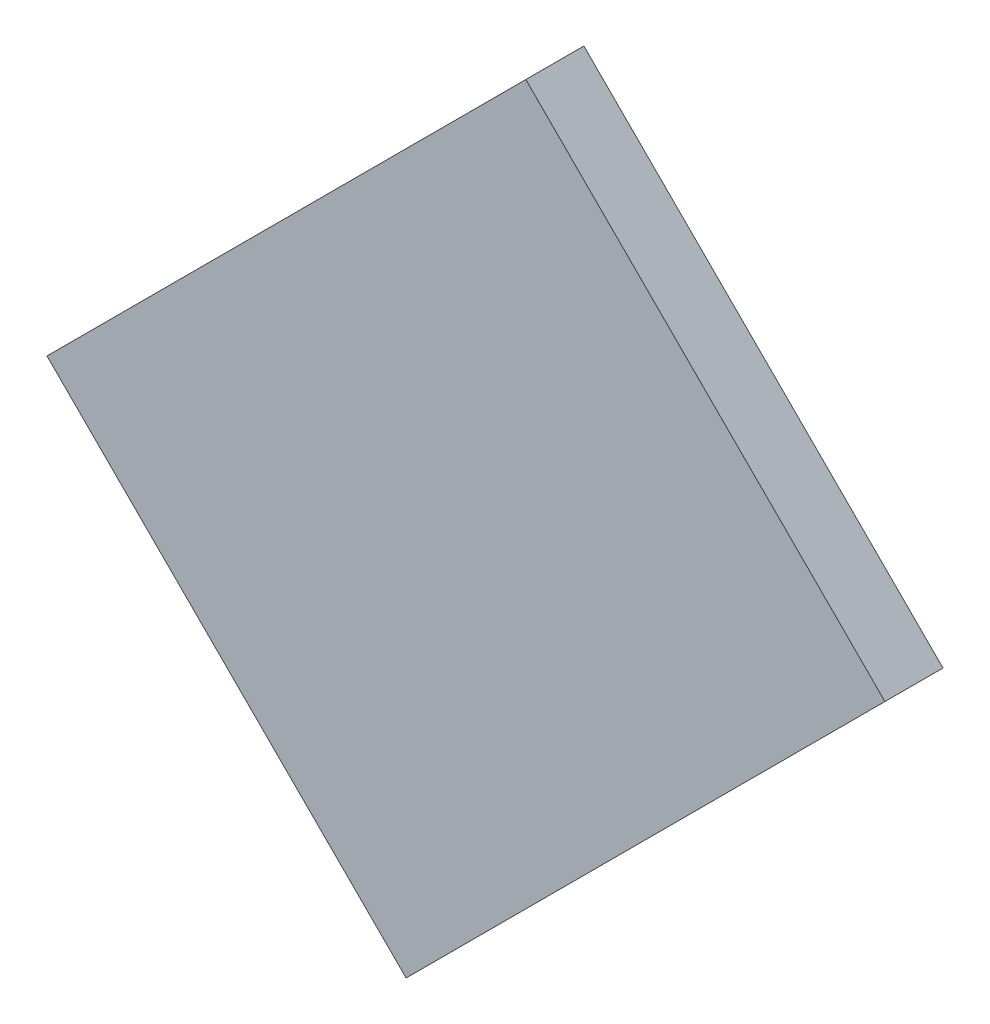
ISO-10303-21;
HEADER;
FILE_DESCRIPTION(('STEP AP214'),'2;1');
FILE_NAME('part.step','',(''),(''),'','','');
FILE_SCHEMA(('AUTOMOTIVE_DESIGN { 1 0 10303 214 1 1 1 1 }'));
ENDSEC;
DATA;
#1=APPLICATION_CONTEXT('core data for automotive mechanical design processes');
#2=APPLICATION_PROTOCOL_DEFINITION('international standard','automotive_design',2000,#1);
#3=PRODUCT_CONTEXT('',#1,'mechanical');
#4=PRODUCT('Part','Part','',(#3));
#5=PRODUCT_RELATED_PRODUCT_CATEGORY('part','',(#4));
#6=PRODUCT_DEFINITION_FORMATION('','',#4);
#7=PRODUCT_DEFINITION_CONTEXT('part definition',#1,'design');
#8=PRODUCT_DEFINITION('design','',#6,#7);
#9=PRODUCT_DEFINITION_SHAPE('','',#8);
#10=(LENGTH_UNIT() NAMED_UNIT(*) SI_UNIT(.MILLI.,.METRE.));
#11=(NAMED_UNIT(*) PLANE_ANGLE_UNIT() SI_UNIT($,.RADIAN.));
#12=(NAMED_UNIT(*) SI_UNIT($,.STERADIAN.) SOLID_ANGLE_UNIT());
#13=UNCERTAINTY_MEASURE_WITH_UNIT(LENGTH_MEASURE(1.E-05),#10,'distance_accuracy_value','');
#14=(GEOMETRIC_REPRESENTATION_CONTEXT(3) GLOBAL_UNCERTAINTY_ASSIGNED_CONTEXT((#13)) GLOBAL_UNIT_ASSIGNED_CONTEXT((#10,
#11,#12)) REPRESENTATION_CONTEXT('',''));
#15=CARTESIAN_POINT('',(0.,0.,0.));
#16=DIRECTION('',(0.,0.,1.));
#17=DIRECTION('',(1.,0.,0.));
#18=AXIS2_PLACEMENT_3D('',#15,#16,#17);
#19=CARTESIAN_POINT('',(3.8060453335,9.5543546665,0.76487));
#20=DIRECTION('',(0.,0.,-1.));
#21=DIRECTION('',(0.,1.,0.));
#22=AXIS2_PLACEMENT_3D('',#19,#20,#21);
#23=PLANE('',#22);
#24=DIRECTION('',(0.707106781186548,0.707106781186548,0.));
#25=VECTOR('',#24,1.);
#26=CARTESIAN_POINT('',(3.558558,9.518999333,0.76487));
#27=LINE('',#26,#25);
#28=CARTESIAN_POINT('',(3.558558,9.518999333,0.76487));
#29=VERTEX_POINT('',#28);
#30=CARTESIAN_POINT('',(3.841400667,9.801842,0.76487));
#31=VERTEX_POINT('',#30);
#32=EDGE_CURVE('E55',#29,#31,#27,.T.);
#33=ORIENTED_EDGE('',*,*,#32,.T.);
#34=DIRECTION('',(0.707106781186548,-0.707106781186548,0.));
#35=VECTOR('',#34,1.);
#36=CARTESIAN_POINT('',(3.841400667,9.801842,0.76487));
#37=LINE('',#36,#35);
#38=CARTESIAN_POINT('',(4.053532667,9.58971,0.76487));
#39=VERTEX_POINT('',#38);
#40=EDGE_CURVE('E57',#31,#39,#37,.T.);
#41=ORIENTED_EDGE('',*,*,#40,.T.);
#42=DIRECTION('',(-0.707106781186548,-0.707106781186548,0.));
#43=VECTOR('',#42,1.);
#44=CARTESIAN_POINT('',(4.053532667,9.58971,0.76487));
#45=LINE('',#44,#43);
#46=CARTESIAN_POINT('',(3.77069,9.306867333,0.76487));
#47=VERTEX_POINT('',#46);
#48=EDGE_CURVE('E20',#39,#47,#45,.T.);
#49=ORIENTED_EDGE('',*,*,#48,.T.);
#50=DIRECTION('',(-0.707106781186548,0.707106781186548,0.));
#51=VECTOR('',#50,1.);
#52=CARTESIAN_POINT('',(3.77069,9.306867333,0.76487));
#53=LINE('',#52,#51);
#54=EDGE_CURVE('E80',#47,#29,#53,.T.);
#55=ORIENTED_EDGE('',*,*,#54,.T.);
#56=EDGE_LOOP('',(#33,#41,#49,#55));
#57=FACE_BOUND('',#56,.T.);
#58=ADVANCED_FACE('F17',(#57),#23,.T.);
#59=CARTESIAN_POINT('',(4.053532667,9.58971,0.76487));
#60=DIRECTION('',(-0.707106781186548,0.707106781186548,0.));
#61=DIRECTION('',(-0.707106781186548,-0.707106781186548,0.));
#62=AXIS2_PLACEMENT_3D('',#59,#60,#61);
#63=PLANE('',#62);
#64=DIRECTION('',(0.,0.,1.));
#65=VECTOR('',#64,1.);
#66=CARTESIAN_POINT('',(3.77069,9.306867333,0.76487));
#67=LINE('',#66,#65);
#68=CARTESIAN_POINT('',(3.77069,9.306867333,0.79916));
#69=VERTEX_POINT('',#68);
#70=EDGE_CURVE('E68',#69,#47,#67,.F.);
#71=ORIENTED_EDGE('',*,*,#70,.T.);
#72=ORIENTED_EDGE('',*,*,#48,.F.);
#73=DIRECTION('',(0.,0.,1.));
#74=VECTOR('',#73,1.);
#75=CARTESIAN_POINT('',(4.053532667,9.58971,0.76487));
#76=LINE('',#75,#74);
#77=CARTESIAN_POINT('',(4.053532667,9.58971,0.79916));
#78=VERTEX_POINT('',#77);
#79=EDGE_CURVE('E63',#39,#78,#76,.T.);
#80=ORIENTED_EDGE('',*,*,#79,.T.);
#81=DIRECTION('',(0.707106781186546,0.707106781186549,0.));
#82=VECTOR('',#81,1.);
#83=CARTESIAN_POINT('',(3.77069,9.306867333,0.79916));
#84=LINE('',#83,#82);
#85=EDGE_CURVE('E83',#69,#78,#84,.T.);
#86=ORIENTED_EDGE('',*,*,#85,.F.);
#87=EDGE_LOOP('',(#71,#72,#80,#86));
#88=FACE_BOUND('',#87,.T.);
#89=ADVANCED_FACE('F65',(#88),#63,.F.);
#90=CARTESIAN_POINT('',(3.841400667,9.801842,0.76487));
#91=DIRECTION('',(-0.707106781186548,-0.707106781186548,0.));
#92=DIRECTION('',(0.707106781186548,-0.707106781186548,0.));
#93=AXIS2_PLACEMENT_3D('',#90,#91,#92);
#94=PLANE('',#93);
#95=ORIENTED_EDGE('',*,*,#79,.F.);
#96=ORIENTED_EDGE('',*,*,#40,.F.);
#97=DIRECTION('',(0.,0.,1.));
#98=VECTOR('',#97,1.);
#99=CARTESIAN_POINT('',(3.841400667,9.801842,0.76487));
#100=LINE('',#99,#98);
#101=CARTESIAN_POINT('',(3.841400667,9.801842,0.79916));
#102=VERTEX_POINT('',#101);
#103=EDGE_CURVE('E75',#31,#102,#100,.T.);
#104=ORIENTED_EDGE('',*,*,#103,.T.);
#105=DIRECTION('',(-0.707106781186544,0.707106781186551,0.));
#106=VECTOR('',#105,1.);
#107=CARTESIAN_POINT('',(4.053532667,9.58971,0.79916));
#108=LINE('',#107,#106);
#109=EDGE_CURVE('E72',#78,#102,#108,.T.);
#110=ORIENTED_EDGE('',*,*,#109,.F.);
#111=EDGE_LOOP('',(#95,#96,#104,#110));
#112=FACE_BOUND('',#111,.T.);
#113=ADVANCED_FACE('F70',(#112),#94,.F.);
#114=CARTESIAN_POINT('',(3.558558,9.518999333,0.76487));
#115=DIRECTION('',(0.707106781186548,-0.707106781186548,0.));
#116=DIRECTION('',(0.707106781186548,0.707106781186548,0.));
#117=AXIS2_PLACEMENT_3D('',#114,#115,#116);
#118=PLANE('',#117);
#119=ORIENTED_EDGE('',*,*,#103,.F.);
#120=ORIENTED_EDGE('',*,*,#32,.F.);
#121=DIRECTION('',(0.,0.,1.));
#122=VECTOR('',#121,1.);
#123=CARTESIAN_POINT('',(3.558558,9.518999333,0.76487));
#124=LINE('',#123,#122);
#125=CARTESIAN_POINT('',(3.558558,9.518999333,0.79916));
#126=VERTEX_POINT('',#125);
#127=EDGE_CURVE('E35',#29,#126,#124,.T.);
#128=ORIENTED_EDGE('',*,*,#127,.T.);
#129=DIRECTION('',(-0.707106781186546,-0.707106781186549,0.));
#130=VECTOR('',#129,1.);
#131=CARTESIAN_POINT('',(3.841400667,9.801842,0.79916));
#132=LINE('',#131,#130);
#133=EDGE_CURVE('E26',#102,#126,#132,.T.);
#134=ORIENTED_EDGE('',*,*,#133,.F.);
#135=EDGE_LOOP('',(#119,#120,#128,#134));
#136=FACE_BOUND('',#135,.T.);
#137=ADVANCED_FACE('F89',(#136),#118,.F.);
#138=CARTESIAN_POINT('',(3.77069,9.306867333,0.76487));
#139=DIRECTION('',(0.707106781186548,0.707106781186548,0.));
#140=DIRECTION('',(-0.707106781186548,0.707106781186548,0.));
#141=AXIS2_PLACEMENT_3D('',#138,#139,#140);
#142=PLANE('',#141);
#143=ORIENTED_EDGE('',*,*,#127,.F.);
#144=ORIENTED_EDGE('',*,*,#54,.F.);
#145=ORIENTED_EDGE('',*,*,#70,.F.);
#146=DIRECTION('',(0.707106781186544,-0.707106781186551,0.));
#147=VECTOR('',#146,1.);
#148=CARTESIAN_POINT('',(3.558558,9.518999333,0.79916));
#149=LINE('',#148,#147);
#150=EDGE_CURVE('E11',#126,#69,#149,.T.);
#151=ORIENTED_EDGE('',*,*,#150,.F.);
#152=EDGE_LOOP('',(#143,#144,#145,#151));
#153=FACE_BOUND('',#152,.T.);
#154=ADVANCED_FACE('F91',(#153),#142,.F.);
#155=CARTESIAN_POINT('',(3.8060453335,9.5543546665,0.79916));
#156=DIRECTION('',(0.,0.,1.));
#157=DIRECTION('',(0.,-1.,0.));
#158=AXIS2_PLACEMENT_3D('',#155,#156,#157);
#159=PLANE('',#158);
#160=ORIENTED_EDGE('',*,*,#133,.T.);
#161=ORIENTED_EDGE('',*,*,#150,.T.);
#162=ORIENTED_EDGE('',*,*,#85,.T.);
#163=ORIENTED_EDGE('',*,*,#109,.T.);
#164=EDGE_LOOP('',(#160,#161,#162,#163));
#165=FACE_BOUND('',#164,.T.);
#166=ADVANCED_FACE('F88',(#165),#159,.T.);
#167=CLOSED_SHELL('',(#58,#89,#113,#137,#154,#166));
#168=MANIFOLD_SOLID_BREP('B1',#167);
#169=ADVANCED_BREP_SHAPE_REPRESENTATION('',(#18,#168),#14);
#170=SHAPE_DEFINITION_REPRESENTATION(#9,#169);
ENDSEC;
END-ISO-10303-21;
